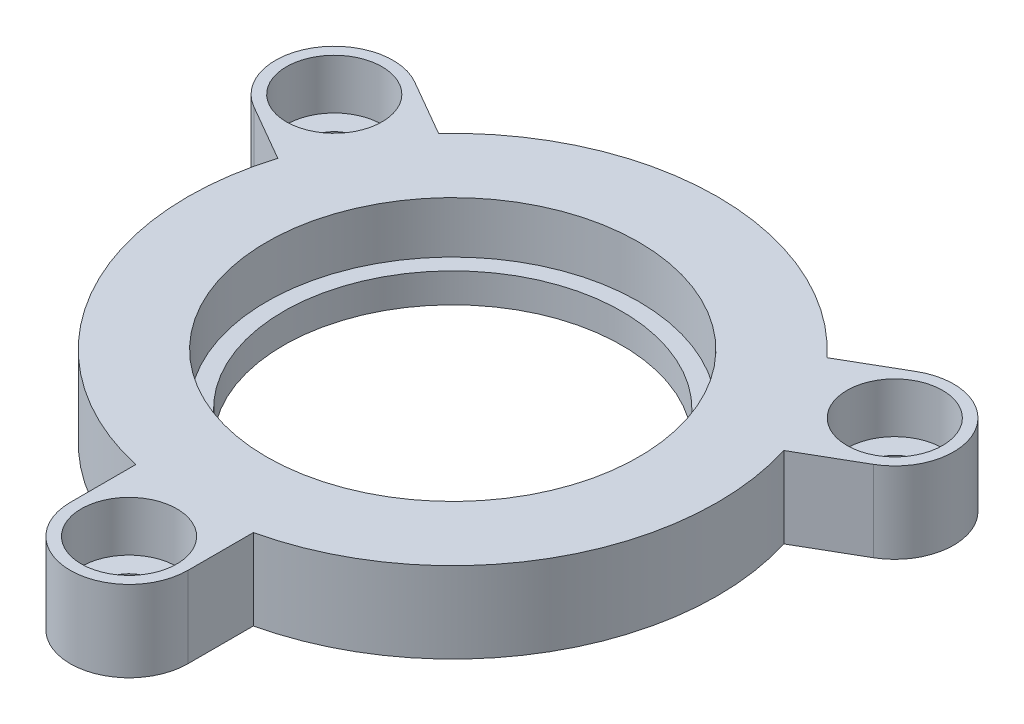
ISO-10303-21;
HEADER;
FILE_DESCRIPTION(('STEP AP214'),'2;1');
FILE_NAME('part.step','',(''),(''),'','','');
FILE_SCHEMA(('AUTOMOTIVE_DESIGN { 1 0 10303 214 1 1 1 1 }'));
ENDSEC;
DATA;
#1=APPLICATION_CONTEXT('core data for automotive mechanical design processes');
#2=APPLICATION_PROTOCOL_DEFINITION('international standard','automotive_design',2000,#1);
#3=PRODUCT_CONTEXT('',#1,'mechanical');
#4=PRODUCT('Part','Part','',(#3));
#5=PRODUCT_RELATED_PRODUCT_CATEGORY('part','',(#4));
#6=PRODUCT_DEFINITION_FORMATION('','',#4);
#7=PRODUCT_DEFINITION_CONTEXT('part definition',#1,'design');
#8=PRODUCT_DEFINITION('design','',#6,#7);
#9=PRODUCT_DEFINITION_SHAPE('','',#8);
#10=(LENGTH_UNIT() NAMED_UNIT(*) SI_UNIT(.MILLI.,.METRE.));
#11=(NAMED_UNIT(*) PLANE_ANGLE_UNIT() SI_UNIT($,.RADIAN.));
#12=(NAMED_UNIT(*) SI_UNIT($,.STERADIAN.) SOLID_ANGLE_UNIT());
#13=UNCERTAINTY_MEASURE_WITH_UNIT(LENGTH_MEASURE(1.E-05),#10,'distance_accuracy_value','');
#14=(GEOMETRIC_REPRESENTATION_CONTEXT(3) GLOBAL_UNCERTAINTY_ASSIGNED_CONTEXT((#13)) GLOBAL_UNIT_ASSIGNED_CONTEXT((#10,
#11,#12)) REPRESENTATION_CONTEXT('',''));
#15=CARTESIAN_POINT('',(0.,0.,0.));
#16=DIRECTION('',(0.,0.,1.));
#17=DIRECTION('',(1.,0.,0.));
#18=AXIS2_PLACEMENT_3D('',#15,#16,#17);
#19=CARTESIAN_POINT('',(0.,5.5,0.));
#20=DIRECTION('',(0.,-1.,0.));
#21=DIRECTION('',(0.,0.,-1.));
#22=AXIS2_PLACEMENT_3D('',#19,#20,#21);
#23=CYLINDRICAL_SURFACE('',#22,11.5);
#24=CARTESIAN_POINT('',(0.,0.,0.));
#25=DIRECTION('',(0.,1.,0.));
#26=DIRECTION('',(0.,0.,1.));
#27=AXIS2_PLACEMENT_3D('',#24,#25,#26);
#28=CIRCLE('',#27,11.5);
#29=CARTESIAN_POINT('',(0.,0.,11.5));
#30=VERTEX_POINT('',#29);
#31=EDGE_CURVE('E214',#30,#30,#28,.T.);
#32=ORIENTED_EDGE('',*,*,#31,.F.);
#33=EDGE_LOOP('',(#32));
#34=FACE_BOUND('',#33,.T.);
#35=CARTESIAN_POINT('',(0.,2.,0.));
#36=DIRECTION('',(0.,1.,0.));
#37=DIRECTION('',(0.,0.,1.));
#38=AXIS2_PLACEMENT_3D('',#35,#36,#37);
#39=CIRCLE('',#38,11.5);
#40=CARTESIAN_POINT('',(0.,2.,11.5));
#41=VERTEX_POINT('',#40);
#42=EDGE_CURVE('E217',#41,#41,#39,.T.);
#43=ORIENTED_EDGE('',*,*,#42,.T.);
#44=EDGE_LOOP('',(#43));
#45=FACE_BOUND('',#44,.T.);
#46=ADVANCED_FACE('F87',(#34,#45),#23,.F.);
#47=CARTESIAN_POINT('',(-4.,5.5,0.));
#48=DIRECTION('',(-1.,0.,0.));
#49=DIRECTION('',(0.,0.,1.));
#50=AXIS2_PLACEMENT_3D('',#47,#48,#49);
#51=PLANE('',#50);
#52=DIRECTION('',(0.,0.,-1.));
#53=VECTOR('',#52,1.);
#54=CARTESIAN_POINT('',(-4.,0.,0.));
#55=LINE('',#54,#53);
#56=CARTESIAN_POINT('',(-4.,0.,22.));
#57=VERTEX_POINT('',#56);
#58=CARTESIAN_POINT('',(-4.,0.,17.5499287747842));
#59=VERTEX_POINT('',#58);
#60=EDGE_CURVE('E269',#57,#59,#55,.T.);
#61=ORIENTED_EDGE('',*,*,#60,.F.);
#62=DIRECTION('',(0.,-1.,0.));
#63=VECTOR('',#62,1.);
#64=CARTESIAN_POINT('',(-4.,5.5,22.));
#65=LINE('',#64,#63);
#66=CARTESIAN_POINT('',(-4.,5.5,22.));
#67=VERTEX_POINT('',#66);
#68=EDGE_CURVE('E97',#67,#57,#65,.T.);
#69=ORIENTED_EDGE('',*,*,#68,.F.);
#70=DIRECTION('',(0.,0.,-1.));
#71=VECTOR('',#70,1.);
#72=CARTESIAN_POINT('',(-4.,5.5,0.));
#73=LINE('',#72,#71);
#74=CARTESIAN_POINT('',(-4.,5.5,17.5499287747842));
#75=VERTEX_POINT('',#74);
#76=EDGE_CURVE('E260',#67,#75,#73,.T.);
#77=ORIENTED_EDGE('',*,*,#76,.T.);
#78=DIRECTION('',(0.,-1.,0.));
#79=VECTOR('',#78,1.);
#80=CARTESIAN_POINT('',(-4.,5.5,17.5499287747842));
#81=LINE('',#80,#79);
#82=EDGE_CURVE('E12',#75,#59,#81,.T.);
#83=ORIENTED_EDGE('',*,*,#82,.T.);
#84=EDGE_LOOP('',(#61,#69,#77,#83));
#85=FACE_BOUND('',#84,.T.);
#86=ADVANCED_FACE('F334',(#85),#51,.T.);
#87=CARTESIAN_POINT('',(0.,5.5,22.));
#88=DIRECTION('',(0.,-1.,0.));
#89=DIRECTION('',(0.,0.,-1.));
#90=AXIS2_PLACEMENT_3D('',#87,#88,#89);
#91=CYLINDRICAL_SURFACE('',#90,4.);
#92=CARTESIAN_POINT('',(0.,0.,22.));
#93=DIRECTION('',(0.,1.,0.));
#94=DIRECTION('',(0.,0.,1.));
#95=AXIS2_PLACEMENT_3D('',#92,#93,#94);
#96=CIRCLE('',#95,4.);
#97=CARTESIAN_POINT('',(4.,0.,22.));
#98=VERTEX_POINT('',#97);
#99=EDGE_CURVE('E271',#57,#98,#96,.T.);
#100=ORIENTED_EDGE('',*,*,#99,.T.);
#101=DIRECTION('',(0.,-1.,0.));
#102=VECTOR('',#101,1.);
#103=CARTESIAN_POINT('',(4.,5.5,22.));
#104=LINE('',#103,#102);
#105=CARTESIAN_POINT('',(4.,5.5,22.));
#106=VERTEX_POINT('',#105);
#107=EDGE_CURVE('E276',#106,#98,#104,.T.);
#108=ORIENTED_EDGE('',*,*,#107,.F.);
#109=CARTESIAN_POINT('',(0.,5.5,22.));
#110=DIRECTION('',(0.,1.,0.));
#111=DIRECTION('',(0.,0.,1.));
#112=AXIS2_PLACEMENT_3D('',#109,#110,#111);
#113=CIRCLE('',#112,4.);
#114=EDGE_CURVE('E263',#67,#106,#113,.T.);
#115=ORIENTED_EDGE('',*,*,#114,.F.);
#116=ORIENTED_EDGE('',*,*,#68,.T.);
#117=EDGE_LOOP('',(#100,#108,#115,#116));
#118=FACE_BOUND('',#117,.T.);
#119=ADVANCED_FACE('F339',(#118),#91,.T.);
#120=CARTESIAN_POINT('',(4.,5.5,0.));
#121=DIRECTION('',(-1.,0.,0.));
#122=DIRECTION('',(0.,0.,1.));
#123=AXIS2_PLACEMENT_3D('',#120,#121,#122);
#124=PLANE('',#123);
#125=DIRECTION('',(0.,0.,-1.));
#126=VECTOR('',#125,1.);
#127=CARTESIAN_POINT('',(4.,0.,0.));
#128=LINE('',#127,#126);
#129=CARTESIAN_POINT('',(4.,0.,17.5499287747842));
#130=VERTEX_POINT('',#129);
#131=EDGE_CURVE('E264',#98,#130,#128,.T.);
#132=ORIENTED_EDGE('',*,*,#131,.T.);
#133=DIRECTION('',(0.,-1.,0.));
#134=VECTOR('',#133,1.);
#135=CARTESIAN_POINT('',(4.,5.5,17.5499287747842));
#136=LINE('',#135,#134);
#137=CARTESIAN_POINT('',(4.,5.5,17.5499287747842));
#138=VERTEX_POINT('',#137);
#139=EDGE_CURVE('E106',#138,#130,#136,.T.);
#140=ORIENTED_EDGE('',*,*,#139,.F.);
#141=DIRECTION('',(0.,0.,-1.));
#142=VECTOR('',#141,1.);
#143=CARTESIAN_POINT('',(4.,5.5,0.));
#144=LINE('',#143,#142);
#145=EDGE_CURVE('E266',#106,#138,#144,.T.);
#146=ORIENTED_EDGE('',*,*,#145,.F.);
#147=ORIENTED_EDGE('',*,*,#107,.T.);
#148=EDGE_LOOP('',(#132,#140,#146,#147));
#149=FACE_BOUND('',#148,.T.);
#150=ADVANCED_FACE('F360',(#149),#124,.F.);
#151=CARTESIAN_POINT('',(0.,0.,0.));
#152=DIRECTION('',(0.,1.,0.));
#153=DIRECTION('',(0.,0.,1.));
#154=AXIS2_PLACEMENT_3D('',#151,#152,#153);
#155=PLANE('',#154);
#156=CARTESIAN_POINT('',(-19.0525588832576,0.,-11.0000000000001));
#157=DIRECTION('',(0.,1.,0.));
#158=DIRECTION('',(0.,0.,1.));
#159=AXIS2_PLACEMENT_3D('',#156,#157,#158);
#160=CIRCLE('',#159,1.69999999999999);
#161=CARTESIAN_POINT('',(-19.0525588832576,0.,-9.30000000000009));
#162=VERTEX_POINT('',#161);
#163=EDGE_CURVE('E91',#162,#162,#160,.T.);
#164=ORIENTED_EDGE('',*,*,#163,.T.);
#165=EDGE_LOOP('',(#164));
#166=FACE_BOUND('',#165,.T.);
#167=CARTESIAN_POINT('',(19.0525588832577,0.,-10.9999999999998));
#168=DIRECTION('',(0.,1.,0.));
#169=DIRECTION('',(0.,0.,1.));
#170=AXIS2_PLACEMENT_3D('',#167,#168,#169);
#171=CIRCLE('',#170,1.69999999999999);
#172=CARTESIAN_POINT('',(19.0525588832577,0.,-9.29999999999983));
#173=VERTEX_POINT('',#172);
#174=EDGE_CURVE('E233',#173,#173,#171,.T.);
#175=ORIENTED_EDGE('',*,*,#174,.T.);
#176=EDGE_LOOP('',(#175));
#177=FACE_BOUND('',#176,.T.);
#178=CARTESIAN_POINT('',(0.,0.,22.));
#179=DIRECTION('',(0.,1.,0.));
#180=DIRECTION('',(0.,0.,1.));
#181=AXIS2_PLACEMENT_3D('',#178,#179,#180);
#182=CIRCLE('',#181,1.69999999999999);
#183=CARTESIAN_POINT('',(0.,0.,23.7));
#184=VERTEX_POINT('',#183);
#185=EDGE_CURVE('E229',#184,#184,#182,.T.);
#186=ORIENTED_EDGE('',*,*,#185,.T.);
#187=EDGE_LOOP('',(#186));
#188=FACE_BOUND('',#187,.T.);
#189=ORIENTED_EDGE('',*,*,#60,.T.);
#190=CARTESIAN_POINT('',(0.,0.,0.));
#191=DIRECTION('',(0.,1.,0.));
#192=DIRECTION('',(0.,0.,1.));
#193=AXIS2_PLACEMENT_3D('',#190,#191,#192);
#194=CIRCLE('',#193,18.);
#195=CARTESIAN_POINT('',(-17.1986841535706,0.,-5.31086277225445));
#196=VERTEX_POINT('',#195);
#197=EDGE_CURVE('E225',#196,#59,#194,.T.);
#198=ORIENTED_EDGE('',*,*,#197,.F.);
#199=DIRECTION('',(0.866025403784436,0.,0.500000000000004));
#200=VECTOR('',#199,1.);
#201=CARTESIAN_POINT('',(-2.00000000000001,0.,3.46410161513774));
#202=LINE('',#201,#200);
#203=CARTESIAN_POINT('',(-21.0525588832576,0.,-7.53589838486234));
#204=VERTEX_POINT('',#203);
#205=EDGE_CURVE('E293',#204,#196,#202,.T.);
#206=ORIENTED_EDGE('',*,*,#205,.F.);
#207=CARTESIAN_POINT('',(-19.0525588832576,0.,-11.0000000000001));
#208=DIRECTION('',(0.,1.,0.));
#209=DIRECTION('',(0.,0.,1.));
#210=AXIS2_PLACEMENT_3D('',#207,#208,#209);
#211=CIRCLE('',#210,4.);
#212=CARTESIAN_POINT('',(-17.0525588832576,0.,-14.4641016151378));
#213=VERTEX_POINT('',#212);
#214=EDGE_CURVE('E213',#213,#204,#211,.T.);
#215=ORIENTED_EDGE('',*,*,#214,.F.);
#216=DIRECTION('',(0.866025403784436,0.,0.500000000000004));
#217=VECTOR('',#216,1.);
#218=CARTESIAN_POINT('',(2.00000000000002,0.,-3.46410161513775));
#219=LINE('',#218,#217);
#220=CARTESIAN_POINT('',(-13.1986841535706,0.,-12.2390660025299));
#221=VERTEX_POINT('',#220);
#222=EDGE_CURVE('E284',#213,#221,#219,.T.);
#223=ORIENTED_EDGE('',*,*,#222,.T.);
#224=CARTESIAN_POINT('',(13.1986841535708,0.,-12.2390660025298));
#225=VERTEX_POINT('',#224);
#226=EDGE_CURVE('E222',#225,#221,#194,.T.);
#227=ORIENTED_EDGE('',*,*,#226,.F.);
#228=DIRECTION('',(-0.866025403784443,0.,0.499999999999992));
#229=VECTOR('',#228,1.);
#230=CARTESIAN_POINT('',(-1.99999999999997,0.,-3.46410161513777));
#231=LINE('',#230,#229);
#232=CARTESIAN_POINT('',(17.0525588832578,0.,-14.4641016151376));
#233=VERTEX_POINT('',#232);
#234=EDGE_CURVE('E198',#233,#225,#231,.T.);
#235=ORIENTED_EDGE('',*,*,#234,.F.);
#236=CARTESIAN_POINT('',(19.0525588832577,0.,-10.9999999999998));
#237=DIRECTION('',(0.,1.,0.));
#238=DIRECTION('',(0.,0.,1.));
#239=AXIS2_PLACEMENT_3D('',#236,#237,#238);
#240=CIRCLE('',#239,4.);
#241=CARTESIAN_POINT('',(21.0525588832577,0.,-7.53589838486205));
#242=VERTEX_POINT('',#241);
#243=EDGE_CURVE('E180',#242,#233,#240,.T.);
#244=ORIENTED_EDGE('',*,*,#243,.F.);
#245=DIRECTION('',(-0.866025403784443,0.,0.499999999999992));
#246=VECTOR('',#245,1.);
#247=CARTESIAN_POINT('',(1.99999999999997,0.,3.46410161513777));
#248=LINE('',#247,#246);
#249=CARTESIAN_POINT('',(17.1986841535707,0.,-5.31086277225421));
#250=VERTEX_POINT('',#249);
#251=EDGE_CURVE('E195',#242,#250,#248,.T.);
#252=ORIENTED_EDGE('',*,*,#251,.T.);
#253=EDGE_CURVE('E170',#130,#250,#194,.T.);
#254=ORIENTED_EDGE('',*,*,#253,.F.);
#255=ORIENTED_EDGE('',*,*,#131,.F.);
#256=ORIENTED_EDGE('',*,*,#99,.F.);
#257=EDGE_LOOP('',(#189,#198,#206,#215,#223,#227,#235,#244,#252,#254,#255,#256));
#258=FACE_BOUND('',#257,.T.);
#259=ORIENTED_EDGE('',*,*,#31,.T.);
#260=EDGE_LOOP('',(#259));
#261=FACE_BOUND('',#260,.T.);
#262=ADVANCED_FACE('F193',(#166,#177,#188,#258,#261),#155,.F.);
#263=CARTESIAN_POINT('',(0.,5.5,0.));
#264=DIRECTION('',(0.,1.,0.));
#265=DIRECTION('',(0.,0.,1.));
#266=AXIS2_PLACEMENT_3D('',#263,#264,#265);
#267=PLANE('',#266);
#268=CARTESIAN_POINT('',(-19.0525588832576,5.5,-11.0000000000001));
#269=DIRECTION('',(0.,1.,0.));
#270=DIRECTION('',(0.,0.,1.));
#271=AXIS2_PLACEMENT_3D('',#268,#269,#270);
#272=CIRCLE('',#271,3.25);
#273=CARTESIAN_POINT('',(-19.0525588832576,5.5,-7.75000000000009));
#274=VERTEX_POINT('',#273);
#275=EDGE_CURVE('E412',#274,#274,#272,.T.);
#276=ORIENTED_EDGE('',*,*,#275,.F.);
#277=EDGE_LOOP('',(#276));
#278=FACE_BOUND('',#277,.T.);
#279=CARTESIAN_POINT('',(19.0525588832577,5.5,-10.9999999999998));
#280=DIRECTION('',(0.,1.,0.));
#281=DIRECTION('',(0.,0.,1.));
#282=AXIS2_PLACEMENT_3D('',#279,#280,#281);
#283=CIRCLE('',#282,3.25);
#284=CARTESIAN_POINT('',(19.0525588832577,5.5,-7.74999999999982));
#285=VERTEX_POINT('',#284);
#286=EDGE_CURVE('E248',#285,#285,#283,.T.);
#287=ORIENTED_EDGE('',*,*,#286,.F.);
#288=EDGE_LOOP('',(#287));
#289=FACE_BOUND('',#288,.T.);
#290=CARTESIAN_POINT('',(0.,5.5,22.));
#291=DIRECTION('',(0.,1.,0.));
#292=DIRECTION('',(0.,0.,1.));
#293=AXIS2_PLACEMENT_3D('',#290,#291,#292);
#294=CIRCLE('',#293,3.25);
#295=CARTESIAN_POINT('',(0.,5.5,25.25));
#296=VERTEX_POINT('',#295);
#297=EDGE_CURVE('E235',#296,#296,#294,.T.);
#298=ORIENTED_EDGE('',*,*,#297,.F.);
#299=EDGE_LOOP('',(#298));
#300=FACE_BOUND('',#299,.T.);
#301=CARTESIAN_POINT('',(0.,5.5,0.));
#302=DIRECTION('',(0.,1.,0.));
#303=DIRECTION('',(0.,0.,1.));
#304=AXIS2_PLACEMENT_3D('',#301,#302,#303);
#305=CIRCLE('',#304,12.65);
#306=CARTESIAN_POINT('',(0.,5.5,12.65));
#307=VERTEX_POINT('',#306);
#308=EDGE_CURVE('E231',#307,#307,#305,.T.);
#309=ORIENTED_EDGE('',*,*,#308,.F.);
#310=EDGE_LOOP('',(#309));
#311=FACE_BOUND('',#310,.T.);
#312=ORIENTED_EDGE('',*,*,#145,.T.);
#313=CARTESIAN_POINT('',(0.,5.5,0.));
#314=DIRECTION('',(0.,1.,0.));
#315=DIRECTION('',(0.,0.,1.));
#316=AXIS2_PLACEMENT_3D('',#313,#314,#315);
#317=CIRCLE('',#316,18.);
#318=CARTESIAN_POINT('',(17.1986841535707,5.5,-5.31086277225421));
#319=VERTEX_POINT('',#318);
#320=EDGE_CURVE('E221',#138,#319,#317,.T.);
#321=ORIENTED_EDGE('',*,*,#320,.T.);
#322=DIRECTION('',(-0.866025403784443,0.,0.499999999999992));
#323=VECTOR('',#322,1.);
#324=CARTESIAN_POINT('',(1.99999999999997,5.5,3.46410161513777));
#325=LINE('',#324,#323);
#326=CARTESIAN_POINT('',(21.0525588832577,5.5,-7.53589838486205));
#327=VERTEX_POINT('',#326);
#328=EDGE_CURVE('E188',#327,#319,#325,.T.);
#329=ORIENTED_EDGE('',*,*,#328,.F.);
#330=CARTESIAN_POINT('',(19.0525588832577,5.5,-10.9999999999998));
#331=DIRECTION('',(0.,1.,0.));
#332=DIRECTION('',(0.,0.,1.));
#333=AXIS2_PLACEMENT_3D('',#330,#331,#332);
#334=CIRCLE('',#333,4.);
#335=CARTESIAN_POINT('',(17.0525588832578,5.5,-14.4641016151376));
#336=VERTEX_POINT('',#335);
#337=EDGE_CURVE('E182',#327,#336,#334,.T.);
#338=ORIENTED_EDGE('',*,*,#337,.T.);
#339=DIRECTION('',(-0.866025403784443,0.,0.499999999999992));
#340=VECTOR('',#339,1.);
#341=CARTESIAN_POINT('',(-1.99999999999997,5.5,-3.46410161513777));
#342=LINE('',#341,#340);
#343=CARTESIAN_POINT('',(13.1986841535708,5.5,-12.2390660025298));
#344=VERTEX_POINT('',#343);
#345=EDGE_CURVE('E204',#336,#344,#342,.T.);
#346=ORIENTED_EDGE('',*,*,#345,.T.);
#347=CARTESIAN_POINT('',(-13.1986841535706,5.5,-12.2390660025299));
#348=VERTEX_POINT('',#347);
#349=EDGE_CURVE('E200',#344,#348,#317,.T.);
#350=ORIENTED_EDGE('',*,*,#349,.T.);
#351=DIRECTION('',(0.866025403784436,0.,0.500000000000004));
#352=VECTOR('',#351,1.);
#353=CARTESIAN_POINT('',(2.00000000000002,5.5,-3.46410161513775));
#354=LINE('',#353,#352);
#355=CARTESIAN_POINT('',(-17.0525588832576,5.5,-14.4641016151378));
#356=VERTEX_POINT('',#355);
#357=EDGE_CURVE('E287',#356,#348,#354,.T.);
#358=ORIENTED_EDGE('',*,*,#357,.F.);
#359=CARTESIAN_POINT('',(-19.0525588832576,5.5,-11.0000000000001));
#360=DIRECTION('',(0.,1.,0.));
#361=DIRECTION('',(0.,0.,1.));
#362=AXIS2_PLACEMENT_3D('',#359,#360,#361);
#363=CIRCLE('',#362,4.);
#364=CARTESIAN_POINT('',(-21.0525588832576,5.5,-7.53589838486234));
#365=VERTEX_POINT('',#364);
#366=EDGE_CURVE('E280',#356,#365,#363,.T.);
#367=ORIENTED_EDGE('',*,*,#366,.T.);
#368=DIRECTION('',(0.866025403784436,0.,0.500000000000004));
#369=VECTOR('',#368,1.);
#370=CARTESIAN_POINT('',(-2.00000000000001,5.5,3.46410161513774));
#371=LINE('',#370,#369);
#372=CARTESIAN_POINT('',(-17.1986841535706,5.5,-5.31086277225445));
#373=VERTEX_POINT('',#372);
#374=EDGE_CURVE('E283',#365,#373,#371,.T.);
#375=ORIENTED_EDGE('',*,*,#374,.T.);
#376=EDGE_CURVE('E220',#373,#75,#317,.T.);
#377=ORIENTED_EDGE('',*,*,#376,.T.);
#378=ORIENTED_EDGE('',*,*,#76,.F.);
#379=ORIENTED_EDGE('',*,*,#114,.T.);
#380=EDGE_LOOP('',(#312,#321,#329,#338,#346,#350,#358,#367,#375,#377,#378,#379));
#381=FACE_BOUND('',#380,.T.);
#382=ADVANCED_FACE('F308',(#278,#289,#300,#311,#381),#267,.T.);
#383=CARTESIAN_POINT('',(2.00000000000002,5.5,-3.46410161513775));
#384=DIRECTION('',(0.500000000000004,0.,-0.866025403784437));
#385=DIRECTION('',(-0.866025403784437,0.,-0.500000000000004));
#386=AXIS2_PLACEMENT_3D('',#383,#384,#385);
#387=PLANE('',#386);
#388=ORIENTED_EDGE('',*,*,#222,.F.);
#389=DIRECTION('',(0.,-1.,0.));
#390=VECTOR('',#389,1.);
#391=CARTESIAN_POINT('',(-17.0525588832576,5.5,-14.4641016151378));
#392=LINE('',#391,#390);
#393=EDGE_CURVE('E290',#356,#213,#392,.T.);
#394=ORIENTED_EDGE('',*,*,#393,.F.);
#395=ORIENTED_EDGE('',*,*,#357,.T.);
#396=DIRECTION('',(0.,-1.,0.));
#397=VECTOR('',#396,1.);
#398=CARTESIAN_POINT('',(-13.1986841535706,5.5,-12.2390660025299));
#399=LINE('',#398,#397);
#400=EDGE_CURVE('E299',#348,#221,#399,.T.);
#401=ORIENTED_EDGE('',*,*,#400,.T.);
#402=EDGE_LOOP('',(#388,#394,#395,#401));
#403=FACE_BOUND('',#402,.T.);
#404=ADVANCED_FACE('F329',(#403),#387,.T.);
#405=CARTESIAN_POINT('',(-19.0525588832576,5.5,-11.0000000000001));
#406=DIRECTION('',(0.,-1.,0.));
#407=DIRECTION('',(0.,0.,-1.));
#408=AXIS2_PLACEMENT_3D('',#405,#406,#407);
#409=CYLINDRICAL_SURFACE('',#408,4.);
#410=ORIENTED_EDGE('',*,*,#214,.T.);
#411=DIRECTION('',(0.,-1.,0.));
#412=VECTOR('',#411,1.);
#413=CARTESIAN_POINT('',(-21.0525588832576,5.5,-7.53589838486234));
#414=LINE('',#413,#412);
#415=EDGE_CURVE('E272',#365,#204,#414,.T.);
#416=ORIENTED_EDGE('',*,*,#415,.F.);
#417=ORIENTED_EDGE('',*,*,#366,.F.);
#418=ORIENTED_EDGE('',*,*,#393,.T.);
#419=EDGE_LOOP('',(#410,#416,#417,#418));
#420=FACE_BOUND('',#419,.T.);
#421=ADVANCED_FACE('F323',(#420),#409,.T.);
#422=CARTESIAN_POINT('',(-1.99999999999997,5.5,-3.46410161513777));
#423=DIRECTION('',(0.499999999999992,0.,0.866025403784443));
#424=DIRECTION('',(0.866025403784443,0.,-0.499999999999992));
#425=AXIS2_PLACEMENT_3D('',#422,#423,#424);
#426=PLANE('',#425);
#427=ORIENTED_EDGE('',*,*,#234,.T.);
#428=DIRECTION('',(0.,-1.,0.));
#429=VECTOR('',#428,1.);
#430=CARTESIAN_POINT('',(13.1986841535708,5.5,-12.2390660025298));
#431=LINE('',#430,#429);
#432=EDGE_CURVE('E209',#344,#225,#431,.T.);
#433=ORIENTED_EDGE('',*,*,#432,.F.);
#434=ORIENTED_EDGE('',*,*,#345,.F.);
#435=DIRECTION('',(0.,-1.,0.));
#436=VECTOR('',#435,1.);
#437=CARTESIAN_POINT('',(17.0525588832578,5.5,-14.4641016151376));
#438=LINE('',#437,#436);
#439=EDGE_CURVE('E211',#336,#233,#438,.T.);
#440=ORIENTED_EDGE('',*,*,#439,.T.);
#441=EDGE_LOOP('',(#427,#433,#434,#440));
#442=FACE_BOUND('',#441,.T.);
#443=ADVANCED_FACE('F322',(#442),#426,.F.);
#444=CARTESIAN_POINT('',(19.0525588832577,5.5,-10.9999999999998));
#445=DIRECTION('',(0.,-1.,0.));
#446=DIRECTION('',(0.,0.,-1.));
#447=AXIS2_PLACEMENT_3D('',#444,#445,#446);
#448=CYLINDRICAL_SURFACE('',#447,4.);
#449=ORIENTED_EDGE('',*,*,#243,.T.);
#450=ORIENTED_EDGE('',*,*,#439,.F.);
#451=ORIENTED_EDGE('',*,*,#337,.F.);
#452=DIRECTION('',(0.,-1.,0.));
#453=VECTOR('',#452,1.);
#454=CARTESIAN_POINT('',(21.0525588832577,5.5,-7.53589838486205));
#455=LINE('',#454,#453);
#456=EDGE_CURVE('E176',#327,#242,#455,.T.);
#457=ORIENTED_EDGE('',*,*,#456,.T.);
#458=EDGE_LOOP('',(#449,#450,#451,#457));
#459=FACE_BOUND('',#458,.T.);
#460=ADVANCED_FACE('F178',(#459),#448,.T.);
#461=CARTESIAN_POINT('',(-2.00000000000001,5.5,3.46410161513774));
#462=DIRECTION('',(0.500000000000004,0.,-0.866025403784437));
#463=DIRECTION('',(-0.866025403784437,0.,-0.500000000000004));
#464=AXIS2_PLACEMENT_3D('',#461,#462,#463);
#465=PLANE('',#464);
#466=ORIENTED_EDGE('',*,*,#205,.T.);
#467=DIRECTION('',(0.,-1.,0.));
#468=VECTOR('',#467,1.);
#469=CARTESIAN_POINT('',(-17.1986841535706,5.5,-5.31086277225445));
#470=LINE('',#469,#468);
#471=EDGE_CURVE('E301',#373,#196,#470,.T.);
#472=ORIENTED_EDGE('',*,*,#471,.F.);
#473=ORIENTED_EDGE('',*,*,#374,.F.);
#474=ORIENTED_EDGE('',*,*,#415,.T.);
#475=EDGE_LOOP('',(#466,#472,#473,#474));
#476=FACE_BOUND('',#475,.T.);
#477=ADVANCED_FACE('F313',(#476),#465,.F.);
#478=CARTESIAN_POINT('',(1.99999999999997,5.5,3.46410161513777));
#479=DIRECTION('',(0.499999999999992,0.,0.866025403784443));
#480=DIRECTION('',(0.866025403784443,0.,-0.499999999999992));
#481=AXIS2_PLACEMENT_3D('',#478,#479,#480);
#482=PLANE('',#481);
#483=ORIENTED_EDGE('',*,*,#251,.F.);
#484=ORIENTED_EDGE('',*,*,#456,.F.);
#485=ORIENTED_EDGE('',*,*,#328,.T.);
#486=DIRECTION('',(0.,-1.,0.));
#487=VECTOR('',#486,1.);
#488=CARTESIAN_POINT('',(17.1986841535707,5.5,-5.31086277225421));
#489=LINE('',#488,#487);
#490=EDGE_CURVE('E187',#319,#250,#489,.T.);
#491=ORIENTED_EDGE('',*,*,#490,.T.);
#492=EDGE_LOOP('',(#483,#484,#485,#491));
#493=FACE_BOUND('',#492,.T.);
#494=ADVANCED_FACE('F202',(#493),#482,.T.);
#495=CARTESIAN_POINT('',(0.,5.5,0.));
#496=DIRECTION('',(0.,-1.,0.));
#497=DIRECTION('',(0.,0.,-1.));
#498=AXIS2_PLACEMENT_3D('',#495,#496,#497);
#499=CYLINDRICAL_SURFACE('',#498,18.);
#500=ORIENTED_EDGE('',*,*,#400,.F.);
#501=ORIENTED_EDGE('',*,*,#349,.F.);
#502=ORIENTED_EDGE('',*,*,#432,.T.);
#503=ORIENTED_EDGE('',*,*,#226,.T.);
#504=EDGE_LOOP('',(#500,#501,#502,#503));
#505=FACE_BOUND('',#504,.T.);
#506=ADVANCED_FACE('F89',(#505),#499,.T.);
#507=ORIENTED_EDGE('',*,*,#82,.F.);
#508=ORIENTED_EDGE('',*,*,#376,.F.);
#509=ORIENTED_EDGE('',*,*,#471,.T.);
#510=ORIENTED_EDGE('',*,*,#197,.T.);
#511=EDGE_LOOP('',(#507,#508,#509,#510));
#512=FACE_BOUND('',#511,.T.);
#513=ADVANCED_FACE('F312',(#512),#499,.T.);
#514=ORIENTED_EDGE('',*,*,#320,.F.);
#515=ORIENTED_EDGE('',*,*,#139,.T.);
#516=ORIENTED_EDGE('',*,*,#253,.T.);
#517=ORIENTED_EDGE('',*,*,#490,.F.);
#518=EDGE_LOOP('',(#514,#515,#516,#517));
#519=FACE_BOUND('',#518,.T.);
#520=ADVANCED_FACE('F309',(#519),#499,.T.);
#521=CARTESIAN_POINT('',(0.,2.,0.));
#522=DIRECTION('',(0.,1.,0.));
#523=DIRECTION('',(0.,0.,1.));
#524=AXIS2_PLACEMENT_3D('',#521,#522,#523);
#525=CYLINDRICAL_SURFACE('',#524,12.65);
#526=CARTESIAN_POINT('',(0.,2.,0.));
#527=DIRECTION('',(0.,1.,0.));
#528=DIRECTION('',(0.,0.,1.));
#529=AXIS2_PLACEMENT_3D('',#526,#527,#528);
#530=CIRCLE('',#529,12.65);
#531=CARTESIAN_POINT('',(0.,2.,12.65));
#532=VERTEX_POINT('',#531);
#533=EDGE_CURVE('E228',#532,#532,#530,.T.);
#534=ORIENTED_EDGE('',*,*,#533,.F.);
#535=EDGE_LOOP('',(#534));
#536=FACE_BOUND('',#535,.T.);
#537=ORIENTED_EDGE('',*,*,#308,.T.);
#538=EDGE_LOOP('',(#537));
#539=FACE_BOUND('',#538,.T.);
#540=ADVANCED_FACE('F311',(#536,#539),#525,.F.);
#541=CARTESIAN_POINT('',(0.,2.,0.));
#542=DIRECTION('',(0.,1.,0.));
#543=DIRECTION('',(0.,0.,1.));
#544=AXIS2_PLACEMENT_3D('',#541,#542,#543);
#545=PLANE('',#544);
#546=ORIENTED_EDGE('',*,*,#42,.F.);
#547=EDGE_LOOP('',(#546));
#548=FACE_BOUND('',#547,.T.);
#549=ORIENTED_EDGE('',*,*,#533,.T.);
#550=EDGE_LOOP('',(#549));
#551=FACE_BOUND('',#550,.T.);
#552=ADVANCED_FACE('F318',(#548,#551),#545,.T.);
#553=CARTESIAN_POINT('',(0.,5.5,22.));
#554=DIRECTION('',(0.,1.,0.));
#555=DIRECTION('',(0.,0.,1.));
#556=AXIS2_PLACEMENT_3D('',#553,#554,#555);
#557=CYLINDRICAL_SURFACE('',#556,1.69999999999999);
#558=CARTESIAN_POINT('',(0.,2.1,22.));
#559=DIRECTION('',(0.,1.,0.));
#560=DIRECTION('',(0.,0.,1.));
#561=AXIS2_PLACEMENT_3D('',#558,#559,#560);
#562=CIRCLE('',#561,1.7);
#563=CARTESIAN_POINT('',(0.,2.1,23.7));
#564=VERTEX_POINT('',#563);
#565=EDGE_CURVE('E232',#564,#564,#562,.T.);
#566=ORIENTED_EDGE('',*,*,#565,.T.);
#567=EDGE_LOOP('',(#566));
#568=FACE_BOUND('',#567,.T.);
#569=ORIENTED_EDGE('',*,*,#185,.F.);
#570=EDGE_LOOP('',(#569));
#571=FACE_BOUND('',#570,.T.);
#572=ADVANCED_FACE('F369',(#568,#571),#557,.F.);
#573=CARTESIAN_POINT('',(1.7,2.1,22.));
#574=DIRECTION('',(0.,-1.,0.));
#575=DIRECTION('',(0.,0.,-1.));
#576=AXIS2_PLACEMENT_3D('',#573,#574,#575);
#577=PLANE('',#576);
#578=ORIENTED_EDGE('',*,*,#565,.F.);
#579=EDGE_LOOP('',(#578));
#580=FACE_BOUND('',#579,.T.);
#581=CARTESIAN_POINT('',(0.,2.1,22.));
#582=DIRECTION('',(0.,1.,0.));
#583=DIRECTION('',(0.,0.,1.));
#584=AXIS2_PLACEMENT_3D('',#581,#582,#583);
#585=CIRCLE('',#584,3.25);
#586=CARTESIAN_POINT('',(0.,2.1,25.25));
#587=VERTEX_POINT('',#586);
#588=EDGE_CURVE('E240',#587,#587,#585,.T.);
#589=ORIENTED_EDGE('',*,*,#588,.T.);
#590=EDGE_LOOP('',(#589));
#591=FACE_BOUND('',#590,.T.);
#592=ADVANCED_FACE('F373',(#580,#591),#577,.F.);
#593=CARTESIAN_POINT('',(0.,5.5,22.));
#594=DIRECTION('',(0.,1.,0.));
#595=DIRECTION('',(0.,0.,1.));
#596=AXIS2_PLACEMENT_3D('',#593,#594,#595);
#597=CYLINDRICAL_SURFACE('',#596,3.25);
#598=ORIENTED_EDGE('',*,*,#588,.F.);
#599=EDGE_LOOP('',(#598));
#600=FACE_BOUND('',#599,.T.);
#601=ORIENTED_EDGE('',*,*,#297,.T.);
#602=EDGE_LOOP('',(#601));
#603=FACE_BOUND('',#602,.T.);
#604=ADVANCED_FACE('F377',(#600,#603),#597,.F.);
#605=CARTESIAN_POINT('',(19.0525588832577,5.5,-10.9999999999998));
#606=DIRECTION('',(0.,1.,0.));
#607=DIRECTION('',(0.,0.,1.));
#608=AXIS2_PLACEMENT_3D('',#605,#606,#607);
#609=CYLINDRICAL_SURFACE('',#608,1.69999999999999);
#610=CARTESIAN_POINT('',(19.0525588832577,2.1,-10.9999999999998));
#611=DIRECTION('',(0.,1.,0.));
#612=DIRECTION('',(0.,0.,1.));
#613=AXIS2_PLACEMENT_3D('',#610,#611,#612);
#614=CIRCLE('',#613,1.7);
#615=CARTESIAN_POINT('',(19.0525588832577,2.1,-9.29999999999982));
#616=VERTEX_POINT('',#615);
#617=EDGE_CURVE('E236',#616,#616,#614,.T.);
#618=ORIENTED_EDGE('',*,*,#617,.T.);
#619=EDGE_LOOP('',(#618));
#620=FACE_BOUND('',#619,.T.);
#621=ORIENTED_EDGE('',*,*,#174,.F.);
#622=EDGE_LOOP('',(#621));
#623=FACE_BOUND('',#622,.T.);
#624=ADVANCED_FACE('F381',(#620,#623),#609,.F.);
#625=CARTESIAN_POINT('',(20.7525588832577,2.1,-10.9999999999998));
#626=DIRECTION('',(0.,-1.,0.));
#627=DIRECTION('',(0.,0.,-1.));
#628=AXIS2_PLACEMENT_3D('',#625,#626,#627);
#629=PLANE('',#628);
#630=ORIENTED_EDGE('',*,*,#617,.F.);
#631=EDGE_LOOP('',(#630));
#632=FACE_BOUND('',#631,.T.);
#633=CARTESIAN_POINT('',(19.0525588832577,2.1,-10.9999999999998));
#634=DIRECTION('',(0.,1.,0.));
#635=DIRECTION('',(0.,0.,1.));
#636=AXIS2_PLACEMENT_3D('',#633,#634,#635);
#637=CIRCLE('',#636,3.25);
#638=CARTESIAN_POINT('',(19.0525588832577,2.1,-7.74999999999982));
#639=VERTEX_POINT('',#638);
#640=EDGE_CURVE('E243',#639,#639,#637,.T.);
#641=ORIENTED_EDGE('',*,*,#640,.T.);
#642=EDGE_LOOP('',(#641));
#643=FACE_BOUND('',#642,.T.);
#644=ADVANCED_FACE('F385',(#632,#643),#629,.F.);
#645=CARTESIAN_POINT('',(19.0525588832577,5.5,-10.9999999999998));
#646=DIRECTION('',(0.,1.,0.));
#647=DIRECTION('',(0.,0.,1.));
#648=AXIS2_PLACEMENT_3D('',#645,#646,#647);
#649=CYLINDRICAL_SURFACE('',#648,3.25);
#650=ORIENTED_EDGE('',*,*,#640,.F.);
#651=EDGE_LOOP('',(#650));
#652=FACE_BOUND('',#651,.T.);
#653=ORIENTED_EDGE('',*,*,#286,.T.);
#654=EDGE_LOOP('',(#653));
#655=FACE_BOUND('',#654,.T.);
#656=ADVANCED_FACE('F388',(#652,#655),#649,.F.);
#657=CARTESIAN_POINT('',(-19.0525588832576,5.5,-11.0000000000001));
#658=DIRECTION('',(0.,1.,0.));
#659=DIRECTION('',(0.,0.,1.));
#660=AXIS2_PLACEMENT_3D('',#657,#658,#659);
#661=CYLINDRICAL_SURFACE('',#660,1.69999999999999);
#662=CARTESIAN_POINT('',(-19.0525588832576,2.1,-11.0000000000001));
#663=DIRECTION('',(0.,1.,0.));
#664=DIRECTION('',(0.,0.,1.));
#665=AXIS2_PLACEMENT_3D('',#662,#663,#664);
#666=CIRCLE('',#665,1.7);
#667=CARTESIAN_POINT('',(-19.0525588832576,2.1,-9.30000000000009));
#668=VERTEX_POINT('',#667);
#669=EDGE_CURVE('E414',#668,#668,#666,.T.);
#670=ORIENTED_EDGE('',*,*,#669,.T.);
#671=EDGE_LOOP('',(#670));
#672=FACE_BOUND('',#671,.T.);
#673=ORIENTED_EDGE('',*,*,#163,.F.);
#674=EDGE_LOOP('',(#673));
#675=FACE_BOUND('',#674,.T.);
#676=ADVANCED_FACE('F392',(#672,#675),#661,.F.);
#677=CARTESIAN_POINT('',(-17.3525588832576,2.1,-11.0000000000001));
#678=DIRECTION('',(0.,-1.,0.));
#679=DIRECTION('',(0.,0.,-1.));
#680=AXIS2_PLACEMENT_3D('',#677,#678,#679);
#681=PLANE('',#680);
#682=ORIENTED_EDGE('',*,*,#669,.F.);
#683=EDGE_LOOP('',(#682));
#684=FACE_BOUND('',#683,.T.);
#685=CARTESIAN_POINT('',(-19.0525588832576,2.1,-11.0000000000001));
#686=DIRECTION('',(0.,1.,0.));
#687=DIRECTION('',(0.,0.,1.));
#688=AXIS2_PLACEMENT_3D('',#685,#686,#687);
#689=CIRCLE('',#688,3.25);
#690=CARTESIAN_POINT('',(-19.0525588832576,2.1,-7.75000000000009));
#691=VERTEX_POINT('',#690);
#692=EDGE_CURVE('E409',#691,#691,#689,.T.);
#693=ORIENTED_EDGE('',*,*,#692,.T.);
#694=EDGE_LOOP('',(#693));
#695=FACE_BOUND('',#694,.T.);
#696=ADVANCED_FACE('F396',(#684,#695),#681,.F.);
#697=CARTESIAN_POINT('',(-19.0525588832576,5.5,-11.0000000000001));
#698=DIRECTION('',(0.,1.,0.));
#699=DIRECTION('',(0.,0.,1.));
#700=AXIS2_PLACEMENT_3D('',#697,#698,#699);
#701=CYLINDRICAL_SURFACE('',#700,3.25);
#702=ORIENTED_EDGE('',*,*,#692,.F.);
#703=EDGE_LOOP('',(#702));
#704=FACE_BOUND('',#703,.T.);
#705=ORIENTED_EDGE('',*,*,#275,.T.);
#706=EDGE_LOOP('',(#705));
#707=FACE_BOUND('',#706,.T.);
#708=ADVANCED_FACE('F400',(#704,#707),#701,.F.);
#709=CLOSED_SHELL('',(#46,#86,#119,#150,#262,#382,#404,#421,#443,#460,#477,#494,#506,#513,#520,
#540,#552,#572,#592,#604,#624,#644,#656,#676,#696,#708));
#710=MANIFOLD_SOLID_BREP('B2',#709);
#711=ADVANCED_BREP_SHAPE_REPRESENTATION('',(#18,#710),#14);
#712=SHAPE_DEFINITION_REPRESENTATION(#9,#711);
ENDSEC;
END-ISO-10303-21;
